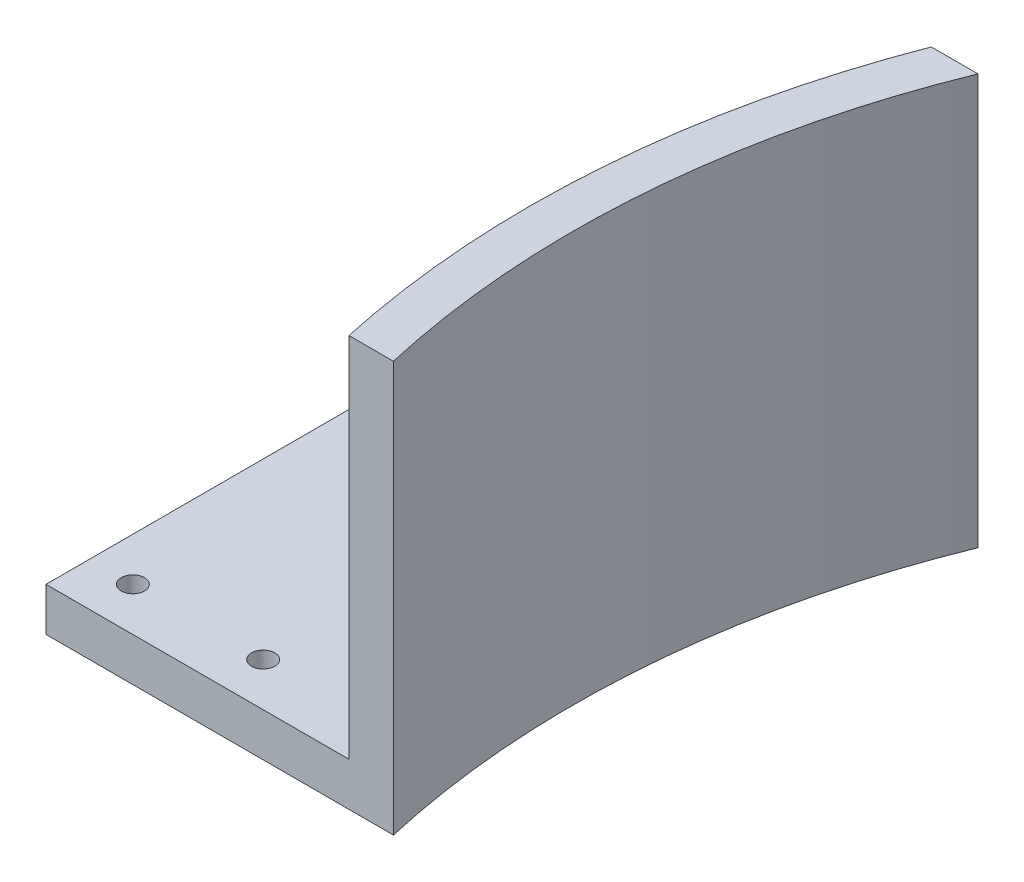
ISO-10303-21;
HEADER;
FILE_DESCRIPTION(('STEP AP214'),'2;1');
FILE_NAME('part.step','',(''),(''),'','','');
FILE_SCHEMA(('AUTOMOTIVE_DESIGN { 1 0 10303 214 1 1 1 1 }'));
ENDSEC;
DATA;
#1=APPLICATION_CONTEXT('core data for automotive mechanical design processes');
#2=APPLICATION_PROTOCOL_DEFINITION('international standard','automotive_design',2000,#1);
#3=PRODUCT_CONTEXT('',#1,'mechanical');
#4=PRODUCT('Part','Part','',(#3));
#5=PRODUCT_RELATED_PRODUCT_CATEGORY('part','',(#4));
#6=PRODUCT_DEFINITION_FORMATION('','',#4);
#7=PRODUCT_DEFINITION_CONTEXT('part definition',#1,'design');
#8=PRODUCT_DEFINITION('design','',#6,#7);
#9=PRODUCT_DEFINITION_SHAPE('','',#8);
#10=(LENGTH_UNIT() NAMED_UNIT(*) SI_UNIT(.MILLI.,.METRE.));
#11=(NAMED_UNIT(*) PLANE_ANGLE_UNIT() SI_UNIT($,.RADIAN.));
#12=(NAMED_UNIT(*) SI_UNIT($,.STERADIAN.) SOLID_ANGLE_UNIT());
#13=UNCERTAINTY_MEASURE_WITH_UNIT(LENGTH_MEASURE(1.E-05),#10,'distance_accuracy_value','');
#14=(GEOMETRIC_REPRESENTATION_CONTEXT(3) GLOBAL_UNCERTAINTY_ASSIGNED_CONTEXT((#13)) GLOBAL_UNIT_ASSIGNED_CONTEXT((#10,
#11,#12)) REPRESENTATION_CONTEXT('',''));
#15=CARTESIAN_POINT('',(0.,0.,0.));
#16=DIRECTION('',(0.,0.,1.));
#17=DIRECTION('',(1.,0.,0.));
#18=AXIS2_PLACEMENT_3D('',#15,#16,#17);
#19=CARTESIAN_POINT('',(50.8,59.999999888,79.121));
#20=DIRECTION('',(0.,0.,-1.));
#21=DIRECTION('',(1.,0.,0.));
#22=AXIS2_PLACEMENT_3D('',#19,#20,#21);
#23=PLANE('',#22);
#24=DIRECTION('',(0.,1.,0.));
#25=VECTOR('',#24,1.);
#26=CARTESIAN_POINT('',(44.2934515267819,-96.2892494846341,79.121));
#27=LINE('',#26,#25);
#28=CARTESIAN_POINT('',(44.2934515267819,6.34999999999999,79.121));
#29=VERTEX_POINT('',#28);
#30=CARTESIAN_POINT('',(44.2934515267819,59.999999888,79.121));
#31=VERTEX_POINT('',#30);
#32=EDGE_CURVE('E148',#29,#31,#27,.T.);
#33=ORIENTED_EDGE('',*,*,#32,.F.);
#34=DIRECTION('',(-1.,0.,0.));
#35=VECTOR('',#34,1.);
#36=CARTESIAN_POINT('',(179.547471402223,6.34999999999999,79.121));
#37=LINE('',#36,#35);
#38=CARTESIAN_POINT('',(0.,6.34999999999999,79.121));
#39=VERTEX_POINT('',#38);
#40=EDGE_CURVE('E120',#29,#39,#37,.T.);
#41=ORIENTED_EDGE('',*,*,#40,.T.);
#42=DIRECTION('',(0.,-1.,0.));
#43=VECTOR('',#42,1.);
#44=CARTESIAN_POINT('',(0.,59.999999888,79.121));
#45=LINE('',#44,#43);
#46=CARTESIAN_POINT('',(0.,0.,79.121));
#47=VERTEX_POINT('',#46);
#48=EDGE_CURVE('E107',#39,#47,#45,.T.);
#49=ORIENTED_EDGE('',*,*,#48,.T.);
#50=DIRECTION('',(-1.,0.,0.));
#51=VECTOR('',#50,1.);
#52=CARTESIAN_POINT('',(50.8,0.,79.121));
#53=LINE('',#52,#51);
#54=CARTESIAN_POINT('',(50.8,0.,79.121));
#55=VERTEX_POINT('',#54);
#56=EDGE_CURVE('E91',#55,#47,#53,.T.);
#57=ORIENTED_EDGE('',*,*,#56,.F.);
#58=DIRECTION('',(0.,-1.,0.));
#59=VECTOR('',#58,1.);
#60=CARTESIAN_POINT('',(50.8,59.999999888,79.121));
#61=LINE('',#60,#59);
#62=CARTESIAN_POINT('',(50.8,59.999999888,79.121));
#63=VERTEX_POINT('',#62);
#64=EDGE_CURVE('E49',#63,#55,#61,.T.);
#65=ORIENTED_EDGE('',*,*,#64,.F.);
#66=DIRECTION('',(-1.,0.,0.));
#67=VECTOR('',#66,1.);
#68=CARTESIAN_POINT('',(50.8,59.999999888,79.121));
#69=LINE('',#68,#67);
#70=EDGE_CURVE('E109',#63,#31,#69,.T.);
#71=ORIENTED_EDGE('',*,*,#70,.T.);
#72=EDGE_LOOP('',(#33,#41,#49,#57,#65,#71));
#73=FACE_BOUND('',#72,.T.);
#74=ADVANCED_FACE('F41',(#73),#23,.F.);
#75=CARTESIAN_POINT('',(0.,59.999999888,79.121));
#76=DIRECTION('',(1.,0.,0.));
#77=DIRECTION('',(0.,0.,1.));
#78=AXIS2_PLACEMENT_3D('',#75,#76,#77);
#79=PLANE('',#78);
#80=DIRECTION('',(0.,0.,-1.));
#81=VECTOR('',#80,1.);
#82=CARTESIAN_POINT('',(0.,6.34999999999999,49.6385474640628));
#83=LINE('',#82,#81);
#84=CARTESIAN_POINT('',(0.,6.34999999999999,0.));
#85=VERTEX_POINT('',#84);
#86=EDGE_CURVE('E126',#39,#85,#83,.T.);
#87=ORIENTED_EDGE('',*,*,#86,.T.);
#88=DIRECTION('',(0.,-1.,0.));
#89=VECTOR('',#88,1.);
#90=CARTESIAN_POINT('',(0.,59.999999888,0.));
#91=LINE('',#90,#89);
#92=CARTESIAN_POINT('',(0.,0.,0.));
#93=VERTEX_POINT('',#92);
#94=EDGE_CURVE('E105',#85,#93,#91,.T.);
#95=ORIENTED_EDGE('',*,*,#94,.T.);
#96=DIRECTION('',(0.,0.,-1.));
#97=VECTOR('',#96,1.);
#98=CARTESIAN_POINT('',(0.,0.,79.121));
#99=LINE('',#98,#97);
#100=EDGE_CURVE('E97',#47,#93,#99,.T.);
#101=ORIENTED_EDGE('',*,*,#100,.F.);
#102=ORIENTED_EDGE('',*,*,#48,.F.);
#103=EDGE_LOOP('',(#87,#95,#101,#102));
#104=FACE_BOUND('',#103,.T.);
#105=ADVANCED_FACE('F123',(#104),#79,.F.);
#106=CARTESIAN_POINT('',(0.,59.999999888,0.));
#107=DIRECTION('',(0.,0.,1.));
#108=DIRECTION('',(-1.,0.,0.));
#109=AXIS2_PLACEMENT_3D('',#106,#107,#108);
#110=PLANE('',#109);
#111=DIRECTION('',(0.,1.,0.));
#112=VECTOR('',#111,1.);
#113=CARTESIAN_POINT('',(50.3233269645136,-96.2892494846341,0.));
#114=LINE('',#113,#112);
#115=CARTESIAN_POINT('',(50.3233269645136,6.34999999999999,0.));
#116=VERTEX_POINT('',#115);
#117=CARTESIAN_POINT('',(50.3233269645136,59.999999888,0.));
#118=VERTEX_POINT('',#117);
#119=EDGE_CURVE('E92',#116,#118,#114,.T.);
#120=ORIENTED_EDGE('',*,*,#119,.T.);
#121=DIRECTION('',(1.,0.,0.));
#122=VECTOR('',#121,1.);
#123=CARTESIAN_POINT('',(0.,59.999999888,0.));
#124=LINE('',#123,#122);
#125=CARTESIAN_POINT('',(57.15,59.999999888,0.));
#126=VERTEX_POINT('',#125);
#127=EDGE_CURVE('E104',#118,#126,#124,.T.);
#128=ORIENTED_EDGE('',*,*,#127,.T.);
#129=DIRECTION('',(0.,-1.,0.));
#130=VECTOR('',#129,1.);
#131=CARTESIAN_POINT('',(57.15,59.999999888,0.));
#132=LINE('',#131,#130);
#133=CARTESIAN_POINT('',(57.15,0.,0.));
#134=VERTEX_POINT('',#133);
#135=EDGE_CURVE('E85',#126,#134,#132,.T.);
#136=ORIENTED_EDGE('',*,*,#135,.T.);
#137=DIRECTION('',(1.,0.,0.));
#138=VECTOR('',#137,1.);
#139=CARTESIAN_POINT('',(0.,0.,0.));
#140=LINE('',#139,#138);
#141=EDGE_CURVE('E95',#93,#134,#140,.T.);
#142=ORIENTED_EDGE('',*,*,#141,.F.);
#143=ORIENTED_EDGE('',*,*,#94,.F.);
#144=DIRECTION('',(1.,0.,0.));
#145=VECTOR('',#144,1.);
#146=CARTESIAN_POINT('',(0.,6.35,0.));
#147=LINE('',#146,#145);
#148=EDGE_CURVE('E12',#85,#116,#147,.T.);
#149=ORIENTED_EDGE('',*,*,#148,.T.);
#150=EDGE_LOOP('',(#120,#128,#136,#142,#143,#149));
#151=FACE_BOUND('',#150,.T.);
#152=ADVANCED_FACE('F103',(#151),#110,.F.);
#153=CARTESIAN_POINT('',(179.547471402223,59.999999888,49.6385474640628));
#154=DIRECTION('',(0.,1.,0.));
#155=DIRECTION('',(0.,0.,-1.));
#156=AXIS2_PLACEMENT_3D('',#153,#154,#155);
#157=PLANE('',#156);
#158=ORIENTED_EDGE('',*,*,#70,.F.);
#159=CARTESIAN_POINT('',(179.547471402223,59.999999888,49.6385474640628));
#160=DIRECTION('',(0.,1.,0.));
#161=DIRECTION('',(0.,0.,-1.));
#162=AXIS2_PLACEMENT_3D('',#159,#160,#161);
#163=CIRCLE('',#162,132.08);
#164=EDGE_CURVE('E64',#126,#63,#163,.T.);
#165=ORIENTED_EDGE('',*,*,#164,.F.);
#166=ORIENTED_EDGE('',*,*,#127,.F.);
#167=CARTESIAN_POINT('',(179.547471402223,59.999999888,49.6385474640628));
#168=DIRECTION('',(0.,-1.,0.));
#169=DIRECTION('',(0.,0.,-1.));
#170=AXIS2_PLACEMENT_3D('',#167,#168,#169);
#171=CIRCLE('',#170,138.43);
#172=EDGE_CURVE('E56',#31,#118,#171,.T.);
#173=ORIENTED_EDGE('',*,*,#172,.F.);
#174=EDGE_LOOP('',(#158,#165,#166,#173));
#175=FACE_BOUND('',#174,.T.);
#176=ADVANCED_FACE('F195',(#175),#157,.T.);
#177=CARTESIAN_POINT('',(179.547471402223,59.999999888,49.6385474640628));
#178=DIRECTION('',(0.,-1.,0.));
#179=DIRECTION('',(0.,0.,1.));
#180=AXIS2_PLACEMENT_3D('',#177,#178,#179);
#181=CYLINDRICAL_SURFACE('',#180,132.08);
#182=CARTESIAN_POINT('',(179.547471402223,0.,49.6385474640628));
#183=DIRECTION('',(0.,1.,0.));
#184=DIRECTION('',(0.,0.,-1.));
#185=AXIS2_PLACEMENT_3D('',#182,#183,#184);
#186=CIRCLE('',#185,132.08);
#187=EDGE_CURVE('E82',#134,#55,#186,.T.);
#188=ORIENTED_EDGE('',*,*,#187,.F.);
#189=ORIENTED_EDGE('',*,*,#135,.F.);
#190=ORIENTED_EDGE('',*,*,#164,.T.);
#191=ORIENTED_EDGE('',*,*,#64,.T.);
#192=EDGE_LOOP('',(#188,#189,#190,#191));
#193=FACE_BOUND('',#192,.T.);
#194=ADVANCED_FACE('F43',(#193),#181,.F.);
#195=CARTESIAN_POINT('',(179.547471402223,0.,49.6385474640628));
#196=DIRECTION('',(0.,1.,0.));
#197=DIRECTION('',(0.,0.,-1.));
#198=AXIS2_PLACEMENT_3D('',#195,#196,#197);
#199=PLANE('',#198);
#200=CARTESIAN_POINT('',(6.35000000000066,0.,9.27100000000002));
#201=DIRECTION('',(0.,-1.,0.));
#202=DIRECTION('',(0.,0.,-1.));
#203=AXIS2_PLACEMENT_3D('',#200,#201,#202);
#204=CIRCLE('',#203,1.700000029);
#205=CARTESIAN_POINT('',(6.35000000000066,0.,7.57099997100002));
#206=VERTEX_POINT('',#205);
#207=EDGE_CURVE('E159',#206,#206,#204,.T.);
#208=ORIENTED_EDGE('',*,*,#207,.F.);
#209=EDGE_LOOP('',(#208));
#210=FACE_BOUND('',#209,.T.);
#211=CARTESIAN_POINT('',(25.4,0.,72.771));
#212=DIRECTION('',(0.,-1.,0.));
#213=DIRECTION('',(0.,0.,-1.));
#214=AXIS2_PLACEMENT_3D('',#211,#212,#213);
#215=CIRCLE('',#214,1.700000029);
#216=CARTESIAN_POINT('',(25.4,0.,71.070999971));
#217=VERTEX_POINT('',#216);
#218=EDGE_CURVE('E165',#217,#217,#215,.T.);
#219=ORIENTED_EDGE('',*,*,#218,.F.);
#220=EDGE_LOOP('',(#219));
#221=FACE_BOUND('',#220,.T.);
#222=CARTESIAN_POINT('',(6.35,0.,72.771));
#223=DIRECTION('',(0.,-1.,0.));
#224=DIRECTION('',(0.,0.,-1.));
#225=AXIS2_PLACEMENT_3D('',#222,#223,#224);
#226=CIRCLE('',#225,1.700000029);
#227=CARTESIAN_POINT('',(6.35,0.,71.070999971));
#228=VERTEX_POINT('',#227);
#229=EDGE_CURVE('E149',#228,#228,#226,.T.);
#230=ORIENTED_EDGE('',*,*,#229,.F.);
#231=EDGE_LOOP('',(#230));
#232=FACE_BOUND('',#231,.T.);
#233=ORIENTED_EDGE('',*,*,#187,.T.);
#234=ORIENTED_EDGE('',*,*,#56,.T.);
#235=ORIENTED_EDGE('',*,*,#100,.T.);
#236=ORIENTED_EDGE('',*,*,#141,.T.);
#237=EDGE_LOOP('',(#233,#234,#235,#236));
#238=FACE_BOUND('',#237,.T.);
#239=ADVANCED_FACE('F96',(#210,#221,#232,#238),#199,.F.);
#240=CARTESIAN_POINT('',(179.547471402223,6.35,49.6385474640628));
#241=DIRECTION('',(0.,1.,0.));
#242=DIRECTION('',(0.,0.,-1.));
#243=AXIS2_PLACEMENT_3D('',#240,#241,#242);
#244=PLANE('',#243);
#245=CARTESIAN_POINT('',(6.35000000000066,6.35,9.27100000000002));
#246=DIRECTION('',(0.,-1.,0.));
#247=DIRECTION('',(0.,0.,-1.));
#248=AXIS2_PLACEMENT_3D('',#245,#246,#247);
#249=CIRCLE('',#248,1.700000029);
#250=CARTESIAN_POINT('',(6.35000000000066,6.35,7.57099997100002));
#251=VERTEX_POINT('',#250);
#252=EDGE_CURVE('E162',#251,#251,#249,.T.);
#253=ORIENTED_EDGE('',*,*,#252,.T.);
#254=EDGE_LOOP('',(#253));
#255=FACE_BOUND('',#254,.T.);
#256=CARTESIAN_POINT('',(25.4,6.35,72.771));
#257=DIRECTION('',(0.,-1.,0.));
#258=DIRECTION('',(0.,0.,-1.));
#259=AXIS2_PLACEMENT_3D('',#256,#257,#258);
#260=CIRCLE('',#259,1.700000029);
#261=CARTESIAN_POINT('',(25.4,6.35,71.070999971));
#262=VERTEX_POINT('',#261);
#263=EDGE_CURVE('E156',#262,#262,#260,.T.);
#264=ORIENTED_EDGE('',*,*,#263,.T.);
#265=EDGE_LOOP('',(#264));
#266=FACE_BOUND('',#265,.T.);
#267=CARTESIAN_POINT('',(6.35,6.35,72.771));
#268=DIRECTION('',(0.,-1.,0.));
#269=DIRECTION('',(0.,0.,-1.));
#270=AXIS2_PLACEMENT_3D('',#267,#268,#269);
#271=CIRCLE('',#270,1.700000029);
#272=CARTESIAN_POINT('',(6.35,6.35,71.070999971));
#273=VERTEX_POINT('',#272);
#274=EDGE_CURVE('E153',#273,#273,#271,.T.);
#275=ORIENTED_EDGE('',*,*,#274,.T.);
#276=EDGE_LOOP('',(#275));
#277=FACE_BOUND('',#276,.T.);
#278=ORIENTED_EDGE('',*,*,#148,.F.);
#279=ORIENTED_EDGE('',*,*,#86,.F.);
#280=ORIENTED_EDGE('',*,*,#40,.F.);
#281=CARTESIAN_POINT('',(179.547471402223,6.34999999999999,49.6385474640628));
#282=DIRECTION('',(0.,-1.,0.));
#283=DIRECTION('',(0.,0.,-1.));
#284=AXIS2_PLACEMENT_3D('',#281,#282,#283);
#285=CIRCLE('',#284,138.43);
#286=EDGE_CURVE('E137',#116,#29,#285,.F.);
#287=ORIENTED_EDGE('',*,*,#286,.F.);
#288=EDGE_LOOP('',(#278,#279,#280,#287));
#289=FACE_BOUND('',#288,.T.);
#290=ADVANCED_FACE('F138',(#255,#266,#277,#289),#244,.T.);
#291=CARTESIAN_POINT('',(179.547471402223,-96.2892494846341,49.6385474640628));
#292=DIRECTION('',(0.,1.,0.));
#293=DIRECTION('',(0.,0.,-1.));
#294=AXIS2_PLACEMENT_3D('',#291,#292,#293);
#295=CYLINDRICAL_SURFACE('',#294,138.43);
#296=ORIENTED_EDGE('',*,*,#119,.F.);
#297=ORIENTED_EDGE('',*,*,#286,.T.);
#298=ORIENTED_EDGE('',*,*,#32,.T.);
#299=ORIENTED_EDGE('',*,*,#172,.T.);
#300=EDGE_LOOP('',(#296,#297,#298,#299));
#301=FACE_BOUND('',#300,.T.);
#302=ADVANCED_FACE('F140',(#301),#295,.T.);
#303=CARTESIAN_POINT('',(6.35,0.,72.771));
#304=DIRECTION('',(0.,1.,0.));
#305=DIRECTION('',(0.,0.,-1.));
#306=AXIS2_PLACEMENT_3D('',#303,#304,#305);
#307=CYLINDRICAL_SURFACE('',#306,1.700000029);
#308=ORIENTED_EDGE('',*,*,#229,.T.);
#309=EDGE_LOOP('',(#308));
#310=FACE_BOUND('',#309,.T.);
#311=ORIENTED_EDGE('',*,*,#274,.F.);
#312=EDGE_LOOP('',(#311));
#313=FACE_BOUND('',#312,.T.);
#314=ADVANCED_FACE('F176',(#310,#313),#307,.F.);
#315=CARTESIAN_POINT('',(25.4,0.,72.771));
#316=DIRECTION('',(0.,1.,0.));
#317=DIRECTION('',(0.,0.,-1.));
#318=AXIS2_PLACEMENT_3D('',#315,#316,#317);
#319=CYLINDRICAL_SURFACE('',#318,1.700000029);
#320=ORIENTED_EDGE('',*,*,#218,.T.);
#321=EDGE_LOOP('',(#320));
#322=FACE_BOUND('',#321,.T.);
#323=ORIENTED_EDGE('',*,*,#263,.F.);
#324=EDGE_LOOP('',(#323));
#325=FACE_BOUND('',#324,.T.);
#326=ADVANCED_FACE('F173',(#322,#325),#319,.F.);
#327=CARTESIAN_POINT('',(6.35000000000066,0.,9.27100000000002));
#328=DIRECTION('',(0.,1.,0.));
#329=DIRECTION('',(0.,0.,-1.));
#330=AXIS2_PLACEMENT_3D('',#327,#328,#329);
#331=CYLINDRICAL_SURFACE('',#330,1.700000029);
#332=ORIENTED_EDGE('',*,*,#207,.T.);
#333=EDGE_LOOP('',(#332));
#334=FACE_BOUND('',#333,.T.);
#335=ORIENTED_EDGE('',*,*,#252,.F.);
#336=EDGE_LOOP('',(#335));
#337=FACE_BOUND('',#336,.T.);
#338=ADVANCED_FACE('F175',(#334,#337),#331,.F.);
#339=CLOSED_SHELL('',(#74,#105,#152,#176,#194,#239,#290,#302,#314,#326,#338));
#340=MANIFOLD_SOLID_BREP('B2',#339);
#341=ADVANCED_BREP_SHAPE_REPRESENTATION('',(#18,#340),#14);
#342=SHAPE_DEFINITION_REPRESENTATION(#9,#341);
ENDSEC;
END-ISO-10303-21;
